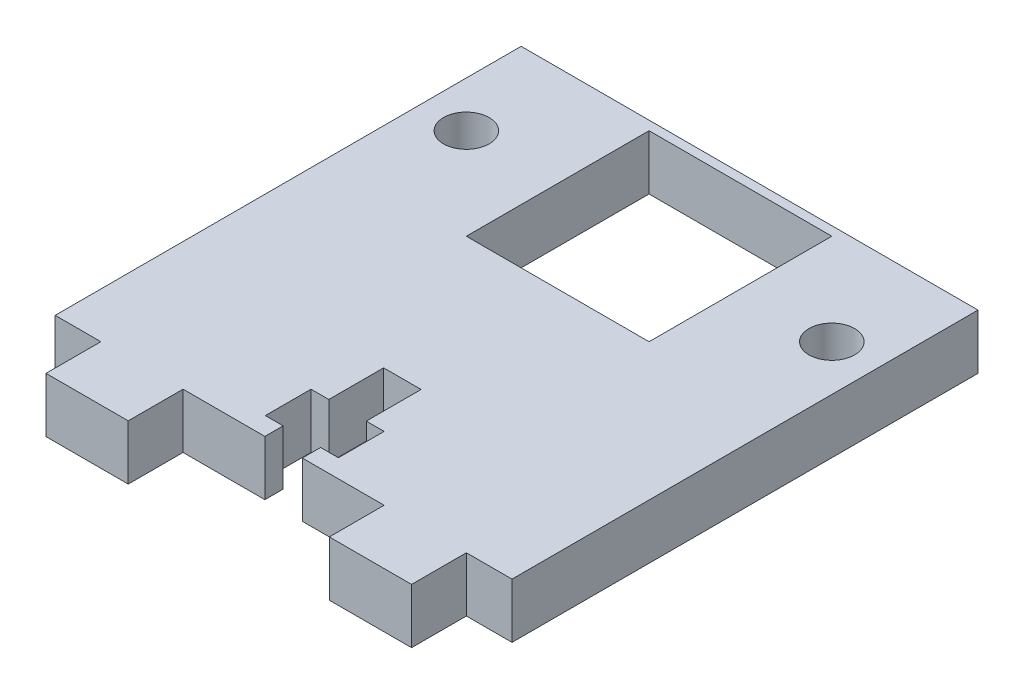
ISO-10303-21;
HEADER;
FILE_DESCRIPTION(('STEP AP214'),'2;1');
FILE_NAME('part.step','',(''),(''),'','','');
FILE_SCHEMA(('AUTOMOTIVE_DESIGN { 1 0 10303 214 1 1 1 1 }'));
ENDSEC;
DATA;
#1=APPLICATION_CONTEXT('core data for automotive mechanical design processes');
#2=APPLICATION_PROTOCOL_DEFINITION('international standard','automotive_design',2000,#1);
#3=PRODUCT_CONTEXT('',#1,'mechanical');
#4=PRODUCT('Part','Part','',(#3));
#5=PRODUCT_RELATED_PRODUCT_CATEGORY('part','',(#4));
#6=PRODUCT_DEFINITION_FORMATION('','',#4);
#7=PRODUCT_DEFINITION_CONTEXT('part definition',#1,'design');
#8=PRODUCT_DEFINITION('design','',#6,#7);
#9=PRODUCT_DEFINITION_SHAPE('','',#8);
#10=(LENGTH_UNIT() NAMED_UNIT(*) SI_UNIT(.MILLI.,.METRE.));
#11=(NAMED_UNIT(*) PLANE_ANGLE_UNIT() SI_UNIT($,.RADIAN.));
#12=(NAMED_UNIT(*) SI_UNIT($,.STERADIAN.) SOLID_ANGLE_UNIT());
#13=UNCERTAINTY_MEASURE_WITH_UNIT(LENGTH_MEASURE(1.E-05),#10,'distance_accuracy_value','');
#14=(GEOMETRIC_REPRESENTATION_CONTEXT(3) GLOBAL_UNCERTAINTY_ASSIGNED_CONTEXT((#13)) GLOBAL_UNIT_ASSIGNED_CONTEXT((#10,
#11,#12)) REPRESENTATION_CONTEXT('',''));
#15=CARTESIAN_POINT('',(0.,0.,0.));
#16=DIRECTION('',(0.,0.,1.));
#17=DIRECTION('',(1.,0.,0.));
#18=AXIS2_PLACEMENT_3D('',#15,#16,#17);
#19=CARTESIAN_POINT('',(0.,6.,0.));
#20=DIRECTION('',(0.,-1.,0.));
#21=DIRECTION('',(0.,0.,-1.));
#22=AXIS2_PLACEMENT_3D('',#19,#20,#21);
#23=PLANE('',#22);
#24=CARTESIAN_POINT('',(20.,6.,0.));
#25=DIRECTION('',(0.,1.,0.));
#26=DIRECTION('',(0.,0.,1.));
#27=AXIS2_PLACEMENT_3D('',#24,#25,#26);
#28=CIRCLE('',#27,2.5);
#29=CARTESIAN_POINT('',(20.,6.,2.5));
#30=VERTEX_POINT('',#29);
#31=EDGE_CURVE('E812',#30,#30,#28,.T.);
#32=ORIENTED_EDGE('',*,*,#31,.F.);
#33=EDGE_LOOP('',(#32));
#34=FACE_BOUND('',#33,.T.);
#35=CARTESIAN_POINT('',(-20.,6.,0.));
#36=DIRECTION('',(0.,1.,0.));
#37=DIRECTION('',(0.,0.,1.));
#38=AXIS2_PLACEMENT_3D('',#35,#36,#37);
#39=CIRCLE('',#38,2.5);
#40=CARTESIAN_POINT('',(-20.,6.,2.5));
#41=VERTEX_POINT('',#40);
#42=EDGE_CURVE('E244',#41,#41,#39,.T.);
#43=ORIENTED_EDGE('',*,*,#42,.F.);
#44=EDGE_LOOP('',(#43));
#45=FACE_BOUND('',#44,.T.);
#46=DIRECTION('',(0.,0.,1.));
#47=VECTOR('',#46,1.);
#48=CARTESIAN_POINT('',(-25.,6.,-11.));
#49=LINE('',#48,#47);
#50=CARTESIAN_POINT('',(-25.,6.,-11.));
#51=VERTEX_POINT('',#50);
#52=CARTESIAN_POINT('',(-25.,6.,40.));
#53=VERTEX_POINT('',#52);
#54=EDGE_CURVE('E254',#51,#53,#49,.T.);
#55=ORIENTED_EDGE('',*,*,#54,.T.);
#56=DIRECTION('',(-1.,0.,0.));
#57=VECTOR('',#56,1.);
#58=CARTESIAN_POINT('',(-20.0040908273477,6.,40.));
#59=LINE('',#58,#57);
#60=CARTESIAN_POINT('',(-20.0040908273477,6.,40.));
#61=VERTEX_POINT('',#60);
#62=EDGE_CURVE('E256',#61,#53,#59,.T.);
#63=ORIENTED_EDGE('',*,*,#62,.F.);
#64=DIRECTION('',(0.,0.,-1.));
#65=VECTOR('',#64,1.);
#66=CARTESIAN_POINT('',(-20.0040908273477,6.,46.));
#67=LINE('',#66,#65);
#68=CARTESIAN_POINT('',(-20.0040908273477,6.,46.));
#69=VERTEX_POINT('',#68);
#70=EDGE_CURVE('E260',#69,#61,#67,.T.);
#71=ORIENTED_EDGE('',*,*,#70,.F.);
#72=DIRECTION('',(-1.,0.,0.));
#73=VECTOR('',#72,1.);
#74=CARTESIAN_POINT('',(-11.0040908273477,6.,46.));
#75=LINE('',#74,#73);
#76=CARTESIAN_POINT('',(-11.0040908273477,6.,46.));
#77=VERTEX_POINT('',#76);
#78=EDGE_CURVE('E263',#77,#69,#75,.T.);
#79=ORIENTED_EDGE('',*,*,#78,.F.);
#80=DIRECTION('',(0.,0.,1.));
#81=VECTOR('',#80,1.);
#82=CARTESIAN_POINT('',(-11.0040908273477,6.,40.));
#83=LINE('',#82,#81);
#84=CARTESIAN_POINT('',(-11.0040908273477,6.,40.));
#85=VERTEX_POINT('',#84);
#86=EDGE_CURVE('E266',#85,#77,#83,.T.);
#87=ORIENTED_EDGE('',*,*,#86,.F.);
#88=DIRECTION('',(1.,0.,0.));
#89=VECTOR('',#88,1.);
#90=CARTESIAN_POINT('',(-11.0040908273477,6.,40.));
#91=LINE('',#90,#89);
#92=CARTESIAN_POINT('',(-2.05,6.,40.));
#93=VERTEX_POINT('',#92);
#94=EDGE_CURVE('E269',#85,#93,#91,.T.);
#95=ORIENTED_EDGE('',*,*,#94,.T.);
#96=DIRECTION('',(0.,0.,-1.));
#97=VECTOR('',#96,1.);
#98=CARTESIAN_POINT('',(-2.05,6.,40.));
#99=LINE('',#98,#97);
#100=CARTESIAN_POINT('',(-2.05,6.,38.));
#101=VERTEX_POINT('',#100);
#102=EDGE_CURVE('E271',#93,#101,#99,.T.);
#103=ORIENTED_EDGE('',*,*,#102,.T.);
#104=DIRECTION('',(-1.,0.,0.));
#105=VECTOR('',#104,1.);
#106=CARTESIAN_POINT('',(-2.05,6.,38.));
#107=LINE('',#106,#105);
#108=CARTESIAN_POINT('',(-4.,6.,38.));
#109=VERTEX_POINT('',#108);
#110=EDGE_CURVE('E273',#101,#109,#107,.T.);
#111=ORIENTED_EDGE('',*,*,#110,.T.);
#112=DIRECTION('',(0.,0.,-1.));
#113=VECTOR('',#112,1.);
#114=CARTESIAN_POINT('',(-4.,6.,38.));
#115=LINE('',#114,#113);
#116=CARTESIAN_POINT('',(-4.,6.,33.));
#117=VERTEX_POINT('',#116);
#118=EDGE_CURVE('E275',#109,#117,#115,.T.);
#119=ORIENTED_EDGE('',*,*,#118,.T.);
#120=DIRECTION('',(1.,0.,0.));
#121=VECTOR('',#120,1.);
#122=CARTESIAN_POINT('',(-4.,6.,33.));
#123=LINE('',#122,#121);
#124=CARTESIAN_POINT('',(-2.05,6.,33.));
#125=VERTEX_POINT('',#124);
#126=EDGE_CURVE('E277',#117,#125,#123,.T.);
#127=ORIENTED_EDGE('',*,*,#126,.T.);
#128=DIRECTION('',(0.,0.,-1.));
#129=VECTOR('',#128,1.);
#130=CARTESIAN_POINT('',(-2.05,6.,33.));
#131=LINE('',#130,#129);
#132=CARTESIAN_POINT('',(-2.05,6.,27.0000000000001));
#133=VERTEX_POINT('',#132);
#134=EDGE_CURVE('E279',#125,#133,#131,.T.);
#135=ORIENTED_EDGE('',*,*,#134,.T.);
#136=DIRECTION('',(1.,0.,0.));
#137=VECTOR('',#136,1.);
#138=CARTESIAN_POINT('',(-2.05,6.,27.0000000000001));
#139=LINE('',#138,#137);
#140=CARTESIAN_POINT('',(2.05,6.,27.0000000000001));
#141=VERTEX_POINT('',#140);
#142=EDGE_CURVE('E281',#133,#141,#139,.T.);
#143=ORIENTED_EDGE('',*,*,#142,.T.);
#144=DIRECTION('',(0.,0.,1.));
#145=VECTOR('',#144,1.);
#146=CARTESIAN_POINT('',(2.05,6.,27.0000000000001));
#147=LINE('',#146,#145);
#148=CARTESIAN_POINT('',(2.05,6.,33.));
#149=VERTEX_POINT('',#148);
#150=EDGE_CURVE('E283',#141,#149,#147,.T.);
#151=ORIENTED_EDGE('',*,*,#150,.T.);
#152=DIRECTION('',(1.,0.,0.));
#153=VECTOR('',#152,1.);
#154=CARTESIAN_POINT('',(2.05,6.,33.));
#155=LINE('',#154,#153);
#156=CARTESIAN_POINT('',(4.,6.,33.));
#157=VERTEX_POINT('',#156);
#158=EDGE_CURVE('E285',#149,#157,#155,.T.);
#159=ORIENTED_EDGE('',*,*,#158,.T.);
#160=DIRECTION('',(0.,0.,1.));
#161=VECTOR('',#160,1.);
#162=CARTESIAN_POINT('',(4.,6.,33.));
#163=LINE('',#162,#161);
#164=CARTESIAN_POINT('',(4.,6.,38.));
#165=VERTEX_POINT('',#164);
#166=EDGE_CURVE('E287',#157,#165,#163,.T.);
#167=ORIENTED_EDGE('',*,*,#166,.T.);
#168=DIRECTION('',(-1.,0.,0.));
#169=VECTOR('',#168,1.);
#170=CARTESIAN_POINT('',(4.,6.,38.));
#171=LINE('',#170,#169);
#172=CARTESIAN_POINT('',(2.05,6.,38.));
#173=VERTEX_POINT('',#172);
#174=EDGE_CURVE('E289',#165,#173,#171,.T.);
#175=ORIENTED_EDGE('',*,*,#174,.T.);
#176=DIRECTION('',(0.,0.,1.));
#177=VECTOR('',#176,1.);
#178=CARTESIAN_POINT('',(2.05,6.,38.));
#179=LINE('',#178,#177);
#180=CARTESIAN_POINT('',(2.05,6.,40.));
#181=VERTEX_POINT('',#180);
#182=EDGE_CURVE('E291',#173,#181,#179,.T.);
#183=ORIENTED_EDGE('',*,*,#182,.T.);
#184=DIRECTION('',(1.,0.,0.));
#185=VECTOR('',#184,1.);
#186=CARTESIAN_POINT('',(2.05,6.,40.));
#187=LINE('',#186,#185);
#188=CARTESIAN_POINT('',(11.0040908273477,6.,40.));
#189=VERTEX_POINT('',#188);
#190=EDGE_CURVE('E293',#181,#189,#187,.T.);
#191=ORIENTED_EDGE('',*,*,#190,.T.);
#192=DIRECTION('',(0.,0.,-1.));
#193=VECTOR('',#192,1.);
#194=CARTESIAN_POINT('',(11.0040908273477,6.,46.));
#195=LINE('',#194,#193);
#196=CARTESIAN_POINT('',(11.0040908273477,6.,46.));
#197=VERTEX_POINT('',#196);
#198=EDGE_CURVE('E295',#197,#189,#195,.T.);
#199=ORIENTED_EDGE('',*,*,#198,.F.);
#200=DIRECTION('',(-1.,0.,0.));
#201=VECTOR('',#200,1.);
#202=CARTESIAN_POINT('',(20.0040908273477,6.,46.));
#203=LINE('',#202,#201);
#204=CARTESIAN_POINT('',(20.0040908273477,6.,46.));
#205=VERTEX_POINT('',#204);
#206=EDGE_CURVE('E298',#205,#197,#203,.T.);
#207=ORIENTED_EDGE('',*,*,#206,.F.);
#208=DIRECTION('',(0.,0.,1.));
#209=VECTOR('',#208,1.);
#210=CARTESIAN_POINT('',(20.0040908273477,6.,40.));
#211=LINE('',#210,#209);
#212=CARTESIAN_POINT('',(20.0040908273477,6.,40.));
#213=VERTEX_POINT('',#212);
#214=EDGE_CURVE('E301',#213,#205,#211,.T.);
#215=ORIENTED_EDGE('',*,*,#214,.F.);
#216=DIRECTION('',(-1.,0.,0.));
#217=VECTOR('',#216,1.);
#218=CARTESIAN_POINT('',(25.,6.,40.));
#219=LINE('',#218,#217);
#220=CARTESIAN_POINT('',(25.,6.,40.));
#221=VERTEX_POINT('',#220);
#222=EDGE_CURVE('E304',#221,#213,#219,.T.);
#223=ORIENTED_EDGE('',*,*,#222,.F.);
#224=DIRECTION('',(0.,0.,-1.));
#225=VECTOR('',#224,1.);
#226=CARTESIAN_POINT('',(25.,6.,40.));
#227=LINE('',#226,#225);
#228=CARTESIAN_POINT('',(25.,6.,-11.));
#229=VERTEX_POINT('',#228);
#230=EDGE_CURVE('E307',#221,#229,#227,.T.);
#231=ORIENTED_EDGE('',*,*,#230,.T.);
#232=DIRECTION('',(1.,0.,0.));
#233=VECTOR('',#232,1.);
#234=CARTESIAN_POINT('',(-25.,6.,-11.));
#235=LINE('',#234,#233);
#236=EDGE_CURVE('E309',#51,#229,#235,.T.);
#237=ORIENTED_EDGE('',*,*,#236,.F.);
#238=EDGE_LOOP('',(#55,#63,#71,#79,#87,#95,#103,#111,#119,#127,#135,#143,#151,#159,#167,#175,
#183,#191,#199,#207,#215,#223,#231,#237));
#239=FACE_BOUND('',#238,.T.);
#240=DIRECTION('',(0.,0.,-1.));
#241=VECTOR('',#240,1.);
#242=CARTESIAN_POINT('',(10.,6.,10.));
#243=LINE('',#242,#241);
#244=CARTESIAN_POINT('',(10.,6.,10.));
#245=VERTEX_POINT('',#244);
#246=CARTESIAN_POINT('',(10.,6.,-9.99999999999999));
#247=VERTEX_POINT('',#246);
#248=EDGE_CURVE('E216',#245,#247,#243,.T.);
#249=ORIENTED_EDGE('',*,*,#248,.F.);
#250=DIRECTION('',(1.,0.,0.));
#251=VECTOR('',#250,1.);
#252=CARTESIAN_POINT('',(-10.,6.,10.));
#253=LINE('',#252,#251);
#254=CARTESIAN_POINT('',(-10.,6.,10.));
#255=VERTEX_POINT('',#254);
#256=EDGE_CURVE('E238',#255,#245,#253,.T.);
#257=ORIENTED_EDGE('',*,*,#256,.F.);
#258=DIRECTION('',(0.,0.,1.));
#259=VECTOR('',#258,1.);
#260=CARTESIAN_POINT('',(-10.,6.,10.));
#261=LINE('',#260,#259);
#262=CARTESIAN_POINT('',(-10.,6.,-9.99999999999999));
#263=VERTEX_POINT('',#262);
#264=EDGE_CURVE('E236',#263,#255,#261,.T.);
#265=ORIENTED_EDGE('',*,*,#264,.F.);
#266=DIRECTION('',(-1.,0.,0.));
#267=VECTOR('',#266,1.);
#268=CARTESIAN_POINT('',(-10.,6.,-9.99999999999999));
#269=LINE('',#268,#267);
#270=EDGE_CURVE('E224',#247,#263,#269,.T.);
#271=ORIENTED_EDGE('',*,*,#270,.F.);
#272=EDGE_LOOP('',(#249,#257,#265,#271));
#273=FACE_BOUND('',#272,.T.);
#274=ADVANCED_FACE('F32',(#34,#45,#239,#273),#23,.F.);
#275=CARTESIAN_POINT('',(0.,0.,0.));
#276=DIRECTION('',(0.,-1.,0.));
#277=DIRECTION('',(0.,0.,-1.));
#278=AXIS2_PLACEMENT_3D('',#275,#276,#277);
#279=PLANE('',#278);
#280=CARTESIAN_POINT('',(20.,0.,0.));
#281=DIRECTION('',(0.,1.,0.));
#282=DIRECTION('',(0.,0.,1.));
#283=AXIS2_PLACEMENT_3D('',#280,#281,#282);
#284=CIRCLE('',#283,2.5);
#285=CARTESIAN_POINT('',(20.,0.,2.5));
#286=VERTEX_POINT('',#285);
#287=EDGE_CURVE('E815',#286,#286,#284,.T.);
#288=ORIENTED_EDGE('',*,*,#287,.T.);
#289=EDGE_LOOP('',(#288));
#290=FACE_BOUND('',#289,.T.);
#291=CARTESIAN_POINT('',(-20.,0.,0.));
#292=DIRECTION('',(0.,1.,0.));
#293=DIRECTION('',(0.,0.,1.));
#294=AXIS2_PLACEMENT_3D('',#291,#292,#293);
#295=CIRCLE('',#294,2.5);
#296=CARTESIAN_POINT('',(-20.,0.,2.5));
#297=VERTEX_POINT('',#296);
#298=EDGE_CURVE('E817',#297,#297,#295,.T.);
#299=ORIENTED_EDGE('',*,*,#298,.T.);
#300=EDGE_LOOP('',(#299));
#301=FACE_BOUND('',#300,.T.);
#302=DIRECTION('',(0.,0.,1.));
#303=VECTOR('',#302,1.);
#304=CARTESIAN_POINT('',(-25.,0.,11.));
#305=LINE('',#304,#303);
#306=CARTESIAN_POINT('',(-25.,0.,-11.));
#307=VERTEX_POINT('',#306);
#308=CARTESIAN_POINT('',(-25.,0.,40.));
#309=VERTEX_POINT('',#308);
#310=EDGE_CURVE('E232',#307,#309,#305,.T.);
#311=ORIENTED_EDGE('',*,*,#310,.F.);
#312=DIRECTION('',(1.,0.,0.));
#313=VECTOR('',#312,1.);
#314=CARTESIAN_POINT('',(-25.,0.,-11.));
#315=LINE('',#314,#313);
#316=CARTESIAN_POINT('',(25.,0.,-11.));
#317=VERTEX_POINT('',#316);
#318=EDGE_CURVE('E257',#307,#317,#315,.T.);
#319=ORIENTED_EDGE('',*,*,#318,.T.);
#320=DIRECTION('',(0.,0.,1.));
#321=VECTOR('',#320,1.);
#322=CARTESIAN_POINT('',(25.,0.,-11.));
#323=LINE('',#322,#321);
#324=CARTESIAN_POINT('',(25.,0.,40.));
#325=VERTEX_POINT('',#324);
#326=EDGE_CURVE('E366',#317,#325,#323,.T.);
#327=ORIENTED_EDGE('',*,*,#326,.T.);
#328=DIRECTION('',(-1.,0.,0.));
#329=VECTOR('',#328,1.);
#330=CARTESIAN_POINT('',(25.,0.,40.));
#331=LINE('',#330,#329);
#332=CARTESIAN_POINT('',(20.0040908273477,0.,40.));
#333=VERTEX_POINT('',#332);
#334=EDGE_CURVE('E363',#325,#333,#331,.T.);
#335=ORIENTED_EDGE('',*,*,#334,.T.);
#336=DIRECTION('',(0.,0.,1.));
#337=VECTOR('',#336,1.);
#338=CARTESIAN_POINT('',(20.0040908273477,0.,40.));
#339=LINE('',#338,#337);
#340=CARTESIAN_POINT('',(20.0040908273477,0.,46.));
#341=VERTEX_POINT('',#340);
#342=EDGE_CURVE('E360',#333,#341,#339,.T.);
#343=ORIENTED_EDGE('',*,*,#342,.T.);
#344=DIRECTION('',(-1.,0.,0.));
#345=VECTOR('',#344,1.);
#346=CARTESIAN_POINT('',(20.0040908273477,0.,46.));
#347=LINE('',#346,#345);
#348=CARTESIAN_POINT('',(11.0040908273477,0.,46.));
#349=VERTEX_POINT('',#348);
#350=EDGE_CURVE('E357',#341,#349,#347,.T.);
#351=ORIENTED_EDGE('',*,*,#350,.T.);
#352=DIRECTION('',(0.,0.,-1.));
#353=VECTOR('',#352,1.);
#354=CARTESIAN_POINT('',(11.0040908273477,0.,46.));
#355=LINE('',#354,#353);
#356=CARTESIAN_POINT('',(11.0040908273477,0.,40.));
#357=VERTEX_POINT('',#356);
#358=EDGE_CURVE('E354',#349,#357,#355,.T.);
#359=ORIENTED_EDGE('',*,*,#358,.T.);
#360=DIRECTION('',(1.,0.,0.));
#361=VECTOR('',#360,1.);
#362=CARTESIAN_POINT('',(2.05,0.,40.));
#363=LINE('',#362,#361);
#364=CARTESIAN_POINT('',(2.05,0.,40.));
#365=VERTEX_POINT('',#364);
#366=EDGE_CURVE('E351',#365,#357,#363,.T.);
#367=ORIENTED_EDGE('',*,*,#366,.F.);
#368=DIRECTION('',(0.,0.,1.));
#369=VECTOR('',#368,1.);
#370=CARTESIAN_POINT('',(2.05,0.,38.));
#371=LINE('',#370,#369);
#372=CARTESIAN_POINT('',(2.05,0.,38.));
#373=VERTEX_POINT('',#372);
#374=EDGE_CURVE('E349',#373,#365,#371,.T.);
#375=ORIENTED_EDGE('',*,*,#374,.F.);
#376=DIRECTION('',(-1.,0.,0.));
#377=VECTOR('',#376,1.);
#378=CARTESIAN_POINT('',(4.,0.,38.));
#379=LINE('',#378,#377);
#380=CARTESIAN_POINT('',(4.,0.,38.));
#381=VERTEX_POINT('',#380);
#382=EDGE_CURVE('E347',#381,#373,#379,.T.);
#383=ORIENTED_EDGE('',*,*,#382,.F.);
#384=DIRECTION('',(0.,0.,1.));
#385=VECTOR('',#384,1.);
#386=CARTESIAN_POINT('',(4.,0.,33.));
#387=LINE('',#386,#385);
#388=CARTESIAN_POINT('',(4.,0.,33.));
#389=VERTEX_POINT('',#388);
#390=EDGE_CURVE('E345',#389,#381,#387,.T.);
#391=ORIENTED_EDGE('',*,*,#390,.F.);
#392=DIRECTION('',(1.,0.,0.));
#393=VECTOR('',#392,1.);
#394=CARTESIAN_POINT('',(2.05,0.,33.));
#395=LINE('',#394,#393);
#396=CARTESIAN_POINT('',(2.05,0.,33.));
#397=VERTEX_POINT('',#396);
#398=EDGE_CURVE('E343',#397,#389,#395,.T.);
#399=ORIENTED_EDGE('',*,*,#398,.F.);
#400=DIRECTION('',(0.,0.,1.));
#401=VECTOR('',#400,1.);
#402=CARTESIAN_POINT('',(2.05,0.,27.0000000000001));
#403=LINE('',#402,#401);
#404=CARTESIAN_POINT('',(2.05,0.,27.0000000000001));
#405=VERTEX_POINT('',#404);
#406=EDGE_CURVE('E341',#405,#397,#403,.T.);
#407=ORIENTED_EDGE('',*,*,#406,.F.);
#408=DIRECTION('',(1.,0.,0.));
#409=VECTOR('',#408,1.);
#410=CARTESIAN_POINT('',(-2.05,0.,27.0000000000001));
#411=LINE('',#410,#409);
#412=CARTESIAN_POINT('',(-2.05,0.,27.0000000000001));
#413=VERTEX_POINT('',#412);
#414=EDGE_CURVE('E339',#413,#405,#411,.T.);
#415=ORIENTED_EDGE('',*,*,#414,.F.);
#416=DIRECTION('',(0.,0.,-1.));
#417=VECTOR('',#416,1.);
#418=CARTESIAN_POINT('',(-2.05,0.,33.));
#419=LINE('',#418,#417);
#420=CARTESIAN_POINT('',(-2.05,0.,33.));
#421=VERTEX_POINT('',#420);
#422=EDGE_CURVE('E337',#421,#413,#419,.T.);
#423=ORIENTED_EDGE('',*,*,#422,.F.);
#424=DIRECTION('',(1.,0.,0.));
#425=VECTOR('',#424,1.);
#426=CARTESIAN_POINT('',(-4.,0.,33.));
#427=LINE('',#426,#425);
#428=CARTESIAN_POINT('',(-4.,0.,33.));
#429=VERTEX_POINT('',#428);
#430=EDGE_CURVE('E335',#429,#421,#427,.T.);
#431=ORIENTED_EDGE('',*,*,#430,.F.);
#432=DIRECTION('',(0.,0.,-1.));
#433=VECTOR('',#432,1.);
#434=CARTESIAN_POINT('',(-4.,0.,38.));
#435=LINE('',#434,#433);
#436=CARTESIAN_POINT('',(-4.,0.,38.));
#437=VERTEX_POINT('',#436);
#438=EDGE_CURVE('E333',#437,#429,#435,.T.);
#439=ORIENTED_EDGE('',*,*,#438,.F.);
#440=DIRECTION('',(-1.,0.,0.));
#441=VECTOR('',#440,1.);
#442=CARTESIAN_POINT('',(-2.05,0.,38.));
#443=LINE('',#442,#441);
#444=CARTESIAN_POINT('',(-2.05,0.,38.));
#445=VERTEX_POINT('',#444);
#446=EDGE_CURVE('E331',#445,#437,#443,.T.);
#447=ORIENTED_EDGE('',*,*,#446,.F.);
#448=DIRECTION('',(0.,0.,-1.));
#449=VECTOR('',#448,1.);
#450=CARTESIAN_POINT('',(-2.05,0.,40.));
#451=LINE('',#450,#449);
#452=CARTESIAN_POINT('',(-2.05,0.,40.));
#453=VERTEX_POINT('',#452);
#454=EDGE_CURVE('E329',#453,#445,#451,.T.);
#455=ORIENTED_EDGE('',*,*,#454,.F.);
#456=DIRECTION('',(1.,0.,0.));
#457=VECTOR('',#456,1.);
#458=CARTESIAN_POINT('',(-11.0040908273477,0.,40.));
#459=LINE('',#458,#457);
#460=CARTESIAN_POINT('',(-11.0040908273477,0.,40.));
#461=VERTEX_POINT('',#460);
#462=EDGE_CURVE('E327',#461,#453,#459,.T.);
#463=ORIENTED_EDGE('',*,*,#462,.F.);
#464=DIRECTION('',(0.,0.,1.));
#465=VECTOR('',#464,1.);
#466=CARTESIAN_POINT('',(-11.0040908273477,0.,40.));
#467=LINE('',#466,#465);
#468=CARTESIAN_POINT('',(-11.0040908273477,0.,46.));
#469=VERTEX_POINT('',#468);
#470=EDGE_CURVE('E324',#461,#469,#467,.T.);
#471=ORIENTED_EDGE('',*,*,#470,.T.);
#472=DIRECTION('',(-1.,0.,0.));
#473=VECTOR('',#472,1.);
#474=CARTESIAN_POINT('',(-11.0040908273477,0.,46.));
#475=LINE('',#474,#473);
#476=CARTESIAN_POINT('',(-20.0040908273477,0.,46.));
#477=VERTEX_POINT('',#476);
#478=EDGE_CURVE('E321',#469,#477,#475,.T.);
#479=ORIENTED_EDGE('',*,*,#478,.T.);
#480=DIRECTION('',(0.,0.,-1.));
#481=VECTOR('',#480,1.);
#482=CARTESIAN_POINT('',(-20.0040908273477,0.,46.));
#483=LINE('',#482,#481);
#484=CARTESIAN_POINT('',(-20.0040908273477,0.,40.));
#485=VERTEX_POINT('',#484);
#486=EDGE_CURVE('E318',#477,#485,#483,.T.);
#487=ORIENTED_EDGE('',*,*,#486,.T.);
#488=DIRECTION('',(-1.,0.,0.));
#489=VECTOR('',#488,1.);
#490=CARTESIAN_POINT('',(-20.0040908273477,0.,40.));
#491=LINE('',#490,#489);
#492=EDGE_CURVE('E315',#485,#309,#491,.T.);
#493=ORIENTED_EDGE('',*,*,#492,.T.);
#494=EDGE_LOOP('',(#311,#319,#327,#335,#343,#351,#359,#367,#375,#383,#391,#399,#407,#415,#423,
#431,#439,#447,#455,#463,#471,#479,#487,#493));
#495=FACE_BOUND('',#494,.T.);
#496=DIRECTION('',(1.,0.,0.));
#497=VECTOR('',#496,1.);
#498=CARTESIAN_POINT('',(-10.,0.,10.));
#499=LINE('',#498,#497);
#500=CARTESIAN_POINT('',(-10.,0.,10.));
#501=VERTEX_POINT('',#500);
#502=CARTESIAN_POINT('',(10.,0.,10.));
#503=VERTEX_POINT('',#502);
#504=EDGE_CURVE('E225',#501,#503,#499,.T.);
#505=ORIENTED_EDGE('',*,*,#504,.T.);
#506=DIRECTION('',(0.,0.,-1.));
#507=VECTOR('',#506,1.);
#508=CARTESIAN_POINT('',(10.,0.,10.));
#509=LINE('',#508,#507);
#510=CARTESIAN_POINT('',(10.,0.,-9.99999999999999));
#511=VERTEX_POINT('',#510);
#512=EDGE_CURVE('E55',#503,#511,#509,.T.);
#513=ORIENTED_EDGE('',*,*,#512,.T.);
#514=DIRECTION('',(-1.,0.,0.));
#515=VECTOR('',#514,1.);
#516=CARTESIAN_POINT('',(-10.,0.,-9.99999999999999));
#517=LINE('',#516,#515);
#518=CARTESIAN_POINT('',(-10.,0.,-9.99999999999999));
#519=VERTEX_POINT('',#518);
#520=EDGE_CURVE('E231',#511,#519,#517,.T.);
#521=ORIENTED_EDGE('',*,*,#520,.T.);
#522=DIRECTION('',(0.,0.,1.));
#523=VECTOR('',#522,1.);
#524=CARTESIAN_POINT('',(-10.,0.,10.));
#525=LINE('',#524,#523);
#526=EDGE_CURVE('E246',#519,#501,#525,.T.);
#527=ORIENTED_EDGE('',*,*,#526,.T.);
#528=EDGE_LOOP('',(#505,#513,#521,#527));
#529=FACE_BOUND('',#528,.T.);
#530=ADVANCED_FACE('F436',(#290,#301,#495,#529),#279,.T.);
#531=CARTESIAN_POINT('',(-25.,6.,11.));
#532=DIRECTION('',(1.,0.,0.));
#533=DIRECTION('',(0.,0.,-1.));
#534=AXIS2_PLACEMENT_3D('',#531,#532,#533);
#535=PLANE('',#534);
#536=ORIENTED_EDGE('',*,*,#310,.T.);
#537=DIRECTION('',(0.,-1.,0.));
#538=VECTOR('',#537,1.);
#539=CARTESIAN_POINT('',(-25.,6.,40.));
#540=LINE('',#539,#538);
#541=EDGE_CURVE('E11',#53,#309,#540,.T.);
#542=ORIENTED_EDGE('',*,*,#541,.F.);
#543=ORIENTED_EDGE('',*,*,#54,.F.);
#544=DIRECTION('',(0.,-1.,0.));
#545=VECTOR('',#544,1.);
#546=CARTESIAN_POINT('',(-25.,6.,-11.));
#547=LINE('',#546,#545);
#548=EDGE_CURVE('E312',#51,#307,#547,.T.);
#549=ORIENTED_EDGE('',*,*,#548,.T.);
#550=EDGE_LOOP('',(#536,#542,#543,#549));
#551=FACE_BOUND('',#550,.T.);
#552=ADVANCED_FACE('F34',(#551),#535,.F.);
#553=CARTESIAN_POINT('',(-20.0040908273477,6.,40.));
#554=DIRECTION('',(0.,0.,1.));
#555=DIRECTION('',(1.,0.,0.));
#556=AXIS2_PLACEMENT_3D('',#553,#554,#555);
#557=PLANE('',#556);
#558=ORIENTED_EDGE('',*,*,#492,.F.);
#559=DIRECTION('',(0.,-1.,0.));
#560=VECTOR('',#559,1.);
#561=CARTESIAN_POINT('',(-20.0040908273477,6.,40.));
#562=LINE('',#561,#560);
#563=EDGE_CURVE('E40',#61,#485,#562,.T.);
#564=ORIENTED_EDGE('',*,*,#563,.F.);
#565=ORIENTED_EDGE('',*,*,#62,.T.);
#566=ORIENTED_EDGE('',*,*,#541,.T.);
#567=EDGE_LOOP('',(#558,#564,#565,#566));
#568=FACE_BOUND('',#567,.T.);
#569=ADVANCED_FACE('F433',(#568),#557,.T.);
#570=CARTESIAN_POINT('',(-20.0040908273477,6.,46.));
#571=DIRECTION('',(-1.,0.,0.));
#572=DIRECTION('',(0.,0.,1.));
#573=AXIS2_PLACEMENT_3D('',#570,#571,#572);
#574=PLANE('',#573);
#575=ORIENTED_EDGE('',*,*,#486,.F.);
#576=DIRECTION('',(0.,-1.,0.));
#577=VECTOR('',#576,1.);
#578=CARTESIAN_POINT('',(-20.0040908273477,6.,46.));
#579=LINE('',#578,#577);
#580=EDGE_CURVE('E425',#69,#477,#579,.T.);
#581=ORIENTED_EDGE('',*,*,#580,.F.);
#582=ORIENTED_EDGE('',*,*,#70,.T.);
#583=ORIENTED_EDGE('',*,*,#563,.T.);
#584=EDGE_LOOP('',(#575,#581,#582,#583));
#585=FACE_BOUND('',#584,.T.);
#586=ADVANCED_FACE('F429',(#585),#574,.T.);
#587=CARTESIAN_POINT('',(-11.0040908273477,6.,46.));
#588=DIRECTION('',(0.,0.,1.));
#589=DIRECTION('',(1.,0.,0.));
#590=AXIS2_PLACEMENT_3D('',#587,#588,#589);
#591=PLANE('',#590);
#592=ORIENTED_EDGE('',*,*,#478,.F.);
#593=DIRECTION('',(0.,-1.,0.));
#594=VECTOR('',#593,1.);
#595=CARTESIAN_POINT('',(-11.0040908273477,6.,46.));
#596=LINE('',#595,#594);
#597=EDGE_CURVE('E423',#77,#469,#596,.T.);
#598=ORIENTED_EDGE('',*,*,#597,.F.);
#599=ORIENTED_EDGE('',*,*,#78,.T.);
#600=ORIENTED_EDGE('',*,*,#580,.T.);
#601=EDGE_LOOP('',(#592,#598,#599,#600));
#602=FACE_BOUND('',#601,.T.);
#603=ADVANCED_FACE('F442',(#602),#591,.T.);
#604=CARTESIAN_POINT('',(-11.0040908273477,6.,40.));
#605=DIRECTION('',(1.,0.,0.));
#606=DIRECTION('',(0.,0.,-1.));
#607=AXIS2_PLACEMENT_3D('',#604,#605,#606);
#608=PLANE('',#607);
#609=ORIENTED_EDGE('',*,*,#470,.F.);
#610=DIRECTION('',(0.,-1.,0.));
#611=VECTOR('',#610,1.);
#612=CARTESIAN_POINT('',(-11.0040908273477,6.,40.));
#613=LINE('',#612,#611);
#614=EDGE_CURVE('E421',#85,#461,#613,.T.);
#615=ORIENTED_EDGE('',*,*,#614,.F.);
#616=ORIENTED_EDGE('',*,*,#86,.T.);
#617=ORIENTED_EDGE('',*,*,#597,.T.);
#618=EDGE_LOOP('',(#609,#615,#616,#617));
#619=FACE_BOUND('',#618,.T.);
#620=ADVANCED_FACE('F536',(#619),#608,.T.);
#621=CARTESIAN_POINT('',(-11.0040908273477,6.,40.));
#622=DIRECTION('',(0.,0.,-1.));
#623=DIRECTION('',(-1.,0.,0.));
#624=AXIS2_PLACEMENT_3D('',#621,#622,#623);
#625=PLANE('',#624);
#626=ORIENTED_EDGE('',*,*,#462,.T.);
#627=DIRECTION('',(0.,-1.,0.));
#628=VECTOR('',#627,1.);
#629=CARTESIAN_POINT('',(-2.05,6.,40.));
#630=LINE('',#629,#628);
#631=EDGE_CURVE('E418',#93,#453,#630,.T.);
#632=ORIENTED_EDGE('',*,*,#631,.F.);
#633=ORIENTED_EDGE('',*,*,#94,.F.);
#634=ORIENTED_EDGE('',*,*,#614,.T.);
#635=EDGE_LOOP('',(#626,#632,#633,#634));
#636=FACE_BOUND('',#635,.T.);
#637=ADVANCED_FACE('F538',(#636),#625,.F.);
#638=CARTESIAN_POINT('',(-2.05,6.,40.));
#639=DIRECTION('',(-1.,0.,0.));
#640=DIRECTION('',(0.,0.,1.));
#641=AXIS2_PLACEMENT_3D('',#638,#639,#640);
#642=PLANE('',#641);
#643=ORIENTED_EDGE('',*,*,#454,.T.);
#644=DIRECTION('',(0.,-1.,0.));
#645=VECTOR('',#644,1.);
#646=CARTESIAN_POINT('',(-2.05,6.,38.));
#647=LINE('',#646,#645);
#648=EDGE_CURVE('E415',#101,#445,#647,.T.);
#649=ORIENTED_EDGE('',*,*,#648,.F.);
#650=ORIENTED_EDGE('',*,*,#102,.F.);
#651=ORIENTED_EDGE('',*,*,#631,.T.);
#652=EDGE_LOOP('',(#643,#649,#650,#651));
#653=FACE_BOUND('',#652,.T.);
#654=ADVANCED_FACE('F532',(#653),#642,.F.);
#655=CARTESIAN_POINT('',(-2.05,6.,38.));
#656=DIRECTION('',(0.,0.,1.));
#657=DIRECTION('',(1.,0.,0.));
#658=AXIS2_PLACEMENT_3D('',#655,#656,#657);
#659=PLANE('',#658);
#660=ORIENTED_EDGE('',*,*,#446,.T.);
#661=DIRECTION('',(0.,-1.,0.));
#662=VECTOR('',#661,1.);
#663=CARTESIAN_POINT('',(-4.,6.,38.));
#664=LINE('',#663,#662);
#665=EDGE_CURVE('E412',#109,#437,#664,.T.);
#666=ORIENTED_EDGE('',*,*,#665,.F.);
#667=ORIENTED_EDGE('',*,*,#110,.F.);
#668=ORIENTED_EDGE('',*,*,#648,.T.);
#669=EDGE_LOOP('',(#660,#666,#667,#668));
#670=FACE_BOUND('',#669,.T.);
#671=ADVANCED_FACE('F528',(#670),#659,.F.);
#672=CARTESIAN_POINT('',(-4.,6.,38.));
#673=DIRECTION('',(-1.,0.,0.));
#674=DIRECTION('',(0.,0.,1.));
#675=AXIS2_PLACEMENT_3D('',#672,#673,#674);
#676=PLANE('',#675);
#677=ORIENTED_EDGE('',*,*,#438,.T.);
#678=DIRECTION('',(0.,-1.,0.));
#679=VECTOR('',#678,1.);
#680=CARTESIAN_POINT('',(-4.,6.,33.));
#681=LINE('',#680,#679);
#682=EDGE_CURVE('E409',#117,#429,#681,.T.);
#683=ORIENTED_EDGE('',*,*,#682,.F.);
#684=ORIENTED_EDGE('',*,*,#118,.F.);
#685=ORIENTED_EDGE('',*,*,#665,.T.);
#686=EDGE_LOOP('',(#677,#683,#684,#685));
#687=FACE_BOUND('',#686,.T.);
#688=ADVANCED_FACE('F523',(#687),#676,.F.);
#689=CARTESIAN_POINT('',(-4.,6.,33.));
#690=DIRECTION('',(0.,0.,-1.));
#691=DIRECTION('',(-1.,0.,0.));
#692=AXIS2_PLACEMENT_3D('',#689,#690,#691);
#693=PLANE('',#692);
#694=ORIENTED_EDGE('',*,*,#430,.T.);
#695=DIRECTION('',(0.,-1.,0.));
#696=VECTOR('',#695,1.);
#697=CARTESIAN_POINT('',(-2.05,6.,33.));
#698=LINE('',#697,#696);
#699=EDGE_CURVE('E406',#125,#421,#698,.T.);
#700=ORIENTED_EDGE('',*,*,#699,.F.);
#701=ORIENTED_EDGE('',*,*,#126,.F.);
#702=ORIENTED_EDGE('',*,*,#682,.T.);
#703=EDGE_LOOP('',(#694,#700,#701,#702));
#704=FACE_BOUND('',#703,.T.);
#705=ADVANCED_FACE('F517',(#704),#693,.F.);
#706=CARTESIAN_POINT('',(-2.05,6.,33.));
#707=DIRECTION('',(-1.,0.,0.));
#708=DIRECTION('',(0.,0.,1.));
#709=AXIS2_PLACEMENT_3D('',#706,#707,#708);
#710=PLANE('',#709);
#711=ORIENTED_EDGE('',*,*,#422,.T.);
#712=DIRECTION('',(0.,-1.,0.));
#713=VECTOR('',#712,1.);
#714=CARTESIAN_POINT('',(-2.05,6.,27.0000000000001));
#715=LINE('',#714,#713);
#716=EDGE_CURVE('E403',#133,#413,#715,.T.);
#717=ORIENTED_EDGE('',*,*,#716,.F.);
#718=ORIENTED_EDGE('',*,*,#134,.F.);
#719=ORIENTED_EDGE('',*,*,#699,.T.);
#720=EDGE_LOOP('',(#711,#717,#718,#719));
#721=FACE_BOUND('',#720,.T.);
#722=ADVANCED_FACE('F513',(#721),#710,.F.);
#723=CARTESIAN_POINT('',(-2.05,6.,27.0000000000001));
#724=DIRECTION('',(0.,0.,-1.));
#725=DIRECTION('',(-1.,0.,0.));
#726=AXIS2_PLACEMENT_3D('',#723,#724,#725);
#727=PLANE('',#726);
#728=ORIENTED_EDGE('',*,*,#414,.T.);
#729=DIRECTION('',(0.,-1.,0.));
#730=VECTOR('',#729,1.);
#731=CARTESIAN_POINT('',(2.05,6.,27.0000000000001));
#732=LINE('',#731,#730);
#733=EDGE_CURVE('E400',#141,#405,#732,.T.);
#734=ORIENTED_EDGE('',*,*,#733,.F.);
#735=ORIENTED_EDGE('',*,*,#142,.F.);
#736=ORIENTED_EDGE('',*,*,#716,.T.);
#737=EDGE_LOOP('',(#728,#734,#735,#736));
#738=FACE_BOUND('',#737,.T.);
#739=ADVANCED_FACE('F508',(#738),#727,.F.);
#740=CARTESIAN_POINT('',(2.05,6.,27.0000000000001));
#741=DIRECTION('',(1.,0.,0.));
#742=DIRECTION('',(0.,0.,-1.));
#743=AXIS2_PLACEMENT_3D('',#740,#741,#742);
#744=PLANE('',#743);
#745=ORIENTED_EDGE('',*,*,#406,.T.);
#746=DIRECTION('',(0.,-1.,0.));
#747=VECTOR('',#746,1.);
#748=CARTESIAN_POINT('',(2.05,6.,33.));
#749=LINE('',#748,#747);
#750=EDGE_CURVE('E397',#149,#397,#749,.T.);
#751=ORIENTED_EDGE('',*,*,#750,.F.);
#752=ORIENTED_EDGE('',*,*,#150,.F.);
#753=ORIENTED_EDGE('',*,*,#733,.T.);
#754=EDGE_LOOP('',(#745,#751,#752,#753));
#755=FACE_BOUND('',#754,.T.);
#756=ADVANCED_FACE('F502',(#755),#744,.F.);
#757=CARTESIAN_POINT('',(2.05,6.,33.));
#758=DIRECTION('',(0.,0.,-1.));
#759=DIRECTION('',(-1.,0.,0.));
#760=AXIS2_PLACEMENT_3D('',#757,#758,#759);
#761=PLANE('',#760);
#762=ORIENTED_EDGE('',*,*,#398,.T.);
#763=DIRECTION('',(0.,-1.,0.));
#764=VECTOR('',#763,1.);
#765=CARTESIAN_POINT('',(4.,6.,33.));
#766=LINE('',#765,#764);
#767=EDGE_CURVE('E394',#157,#389,#766,.T.);
#768=ORIENTED_EDGE('',*,*,#767,.F.);
#769=ORIENTED_EDGE('',*,*,#158,.F.);
#770=ORIENTED_EDGE('',*,*,#750,.T.);
#771=EDGE_LOOP('',(#762,#768,#769,#770));
#772=FACE_BOUND('',#771,.T.);
#773=ADVANCED_FACE('F498',(#772),#761,.F.);
#774=CARTESIAN_POINT('',(4.,6.,33.));
#775=DIRECTION('',(1.,0.,0.));
#776=DIRECTION('',(0.,0.,-1.));
#777=AXIS2_PLACEMENT_3D('',#774,#775,#776);
#778=PLANE('',#777);
#779=ORIENTED_EDGE('',*,*,#390,.T.);
#780=DIRECTION('',(0.,-1.,0.));
#781=VECTOR('',#780,1.);
#782=CARTESIAN_POINT('',(4.,6.,38.));
#783=LINE('',#782,#781);
#784=EDGE_CURVE('E391',#165,#381,#783,.T.);
#785=ORIENTED_EDGE('',*,*,#784,.F.);
#786=ORIENTED_EDGE('',*,*,#166,.F.);
#787=ORIENTED_EDGE('',*,*,#767,.T.);
#788=EDGE_LOOP('',(#779,#785,#786,#787));
#789=FACE_BOUND('',#788,.T.);
#790=ADVANCED_FACE('F493',(#789),#778,.F.);
#791=CARTESIAN_POINT('',(4.,6.,38.));
#792=DIRECTION('',(0.,0.,1.));
#793=DIRECTION('',(1.,0.,0.));
#794=AXIS2_PLACEMENT_3D('',#791,#792,#793);
#795=PLANE('',#794);
#796=ORIENTED_EDGE('',*,*,#382,.T.);
#797=DIRECTION('',(0.,-1.,0.));
#798=VECTOR('',#797,1.);
#799=CARTESIAN_POINT('',(2.05,6.,38.));
#800=LINE('',#799,#798);
#801=EDGE_CURVE('E388',#173,#373,#800,.T.);
#802=ORIENTED_EDGE('',*,*,#801,.F.);
#803=ORIENTED_EDGE('',*,*,#174,.F.);
#804=ORIENTED_EDGE('',*,*,#784,.T.);
#805=EDGE_LOOP('',(#796,#802,#803,#804));
#806=FACE_BOUND('',#805,.T.);
#807=ADVANCED_FACE('F487',(#806),#795,.F.);
#808=CARTESIAN_POINT('',(2.05,6.,38.));
#809=DIRECTION('',(1.,0.,0.));
#810=DIRECTION('',(0.,0.,-1.));
#811=AXIS2_PLACEMENT_3D('',#808,#809,#810);
#812=PLANE('',#811);
#813=ORIENTED_EDGE('',*,*,#374,.T.);
#814=DIRECTION('',(0.,-1.,0.));
#815=VECTOR('',#814,1.);
#816=CARTESIAN_POINT('',(2.05,6.,40.));
#817=LINE('',#816,#815);
#818=EDGE_CURVE('E385',#181,#365,#817,.T.);
#819=ORIENTED_EDGE('',*,*,#818,.F.);
#820=ORIENTED_EDGE('',*,*,#182,.F.);
#821=ORIENTED_EDGE('',*,*,#801,.T.);
#822=EDGE_LOOP('',(#813,#819,#820,#821));
#823=FACE_BOUND('',#822,.T.);
#824=ADVANCED_FACE('F483',(#823),#812,.F.);
#825=CARTESIAN_POINT('',(2.05,6.,40.));
#826=DIRECTION('',(0.,0.,-1.));
#827=DIRECTION('',(-1.,0.,0.));
#828=AXIS2_PLACEMENT_3D('',#825,#826,#827);
#829=PLANE('',#828);
#830=ORIENTED_EDGE('',*,*,#366,.T.);
#831=DIRECTION('',(0.,-1.,0.));
#832=VECTOR('',#831,1.);
#833=CARTESIAN_POINT('',(11.0040908273477,6.,40.));
#834=LINE('',#833,#832);
#835=EDGE_CURVE('E383',#189,#357,#834,.T.);
#836=ORIENTED_EDGE('',*,*,#835,.F.);
#837=ORIENTED_EDGE('',*,*,#190,.F.);
#838=ORIENTED_EDGE('',*,*,#818,.T.);
#839=EDGE_LOOP('',(#830,#836,#837,#838));
#840=FACE_BOUND('',#839,.T.);
#841=ADVANCED_FACE('F478',(#840),#829,.F.);
#842=CARTESIAN_POINT('',(11.0040908273477,6.,46.));
#843=DIRECTION('',(-1.,0.,0.));
#844=DIRECTION('',(0.,0.,1.));
#845=AXIS2_PLACEMENT_3D('',#842,#843,#844);
#846=PLANE('',#845);
#847=ORIENTED_EDGE('',*,*,#358,.F.);
#848=DIRECTION('',(0.,-1.,0.));
#849=VECTOR('',#848,1.);
#850=CARTESIAN_POINT('',(11.0040908273477,6.,46.));
#851=LINE('',#850,#849);
#852=EDGE_CURVE('E381',#197,#349,#851,.T.);
#853=ORIENTED_EDGE('',*,*,#852,.F.);
#854=ORIENTED_EDGE('',*,*,#198,.T.);
#855=ORIENTED_EDGE('',*,*,#835,.T.);
#856=EDGE_LOOP('',(#847,#853,#854,#855));
#857=FACE_BOUND('',#856,.T.);
#858=ADVANCED_FACE('F472',(#857),#846,.T.);
#859=CARTESIAN_POINT('',(20.0040908273477,6.,46.));
#860=DIRECTION('',(0.,0.,1.));
#861=DIRECTION('',(1.,0.,0.));
#862=AXIS2_PLACEMENT_3D('',#859,#860,#861);
#863=PLANE('',#862);
#864=ORIENTED_EDGE('',*,*,#350,.F.);
#865=DIRECTION('',(0.,-1.,0.));
#866=VECTOR('',#865,1.);
#867=CARTESIAN_POINT('',(20.0040908273477,6.,46.));
#868=LINE('',#867,#866);
#869=EDGE_CURVE('E379',#205,#341,#868,.T.);
#870=ORIENTED_EDGE('',*,*,#869,.F.);
#871=ORIENTED_EDGE('',*,*,#206,.T.);
#872=ORIENTED_EDGE('',*,*,#852,.T.);
#873=EDGE_LOOP('',(#864,#870,#871,#872));
#874=FACE_BOUND('',#873,.T.);
#875=ADVANCED_FACE('F468',(#874),#863,.T.);
#876=CARTESIAN_POINT('',(20.0040908273477,6.,40.));
#877=DIRECTION('',(1.,0.,0.));
#878=DIRECTION('',(0.,0.,-1.));
#879=AXIS2_PLACEMENT_3D('',#876,#877,#878);
#880=PLANE('',#879);
#881=ORIENTED_EDGE('',*,*,#342,.F.);
#882=DIRECTION('',(0.,-1.,0.));
#883=VECTOR('',#882,1.);
#884=CARTESIAN_POINT('',(20.0040908273477,6.,40.));
#885=LINE('',#884,#883);
#886=EDGE_CURVE('E377',#213,#333,#885,.T.);
#887=ORIENTED_EDGE('',*,*,#886,.F.);
#888=ORIENTED_EDGE('',*,*,#214,.T.);
#889=ORIENTED_EDGE('',*,*,#869,.T.);
#890=EDGE_LOOP('',(#881,#887,#888,#889));
#891=FACE_BOUND('',#890,.T.);
#892=ADVANCED_FACE('F464',(#891),#880,.T.);
#893=CARTESIAN_POINT('',(25.,6.,40.));
#894=DIRECTION('',(0.,0.,1.));
#895=DIRECTION('',(1.,0.,0.));
#896=AXIS2_PLACEMENT_3D('',#893,#894,#895);
#897=PLANE('',#896);
#898=ORIENTED_EDGE('',*,*,#334,.F.);
#899=DIRECTION('',(0.,-1.,0.));
#900=VECTOR('',#899,1.);
#901=CARTESIAN_POINT('',(25.,6.,40.));
#902=LINE('',#901,#900);
#903=EDGE_CURVE('E374',#221,#325,#902,.T.);
#904=ORIENTED_EDGE('',*,*,#903,.F.);
#905=ORIENTED_EDGE('',*,*,#222,.T.);
#906=ORIENTED_EDGE('',*,*,#886,.T.);
#907=EDGE_LOOP('',(#898,#904,#905,#906));
#908=FACE_BOUND('',#907,.T.);
#909=ADVANCED_FACE('F460',(#908),#897,.T.);
#910=CARTESIAN_POINT('',(25.,6.,-11.));
#911=DIRECTION('',(1.,0.,0.));
#912=DIRECTION('',(0.,0.,-1.));
#913=AXIS2_PLACEMENT_3D('',#910,#911,#912);
#914=PLANE('',#913);
#915=ORIENTED_EDGE('',*,*,#326,.F.);
#916=DIRECTION('',(0.,-1.,0.));
#917=VECTOR('',#916,1.);
#918=CARTESIAN_POINT('',(25.,6.,-11.));
#919=LINE('',#918,#917);
#920=EDGE_CURVE('E372',#229,#317,#919,.T.);
#921=ORIENTED_EDGE('',*,*,#920,.F.);
#922=ORIENTED_EDGE('',*,*,#230,.F.);
#923=ORIENTED_EDGE('',*,*,#903,.T.);
#924=EDGE_LOOP('',(#915,#921,#922,#923));
#925=FACE_BOUND('',#924,.T.);
#926=ADVANCED_FACE('F456',(#925),#914,.T.);
#927=CARTESIAN_POINT('',(-25.,6.,-11.));
#928=DIRECTION('',(0.,0.,-1.));
#929=DIRECTION('',(-1.,0.,0.));
#930=AXIS2_PLACEMENT_3D('',#927,#928,#929);
#931=PLANE('',#930);
#932=ORIENTED_EDGE('',*,*,#318,.F.);
#933=ORIENTED_EDGE('',*,*,#548,.F.);
#934=ORIENTED_EDGE('',*,*,#236,.T.);
#935=ORIENTED_EDGE('',*,*,#920,.T.);
#936=EDGE_LOOP('',(#932,#933,#934,#935));
#937=FACE_BOUND('',#936,.T.);
#938=ADVANCED_FACE('F452',(#937),#931,.T.);
#939=CARTESIAN_POINT('',(10.,6.,10.));
#940=DIRECTION('',(-1.,0.,0.));
#941=DIRECTION('',(0.,0.,1.));
#942=AXIS2_PLACEMENT_3D('',#939,#940,#941);
#943=PLANE('',#942);
#944=ORIENTED_EDGE('',*,*,#512,.F.);
#945=DIRECTION('',(0.,-1.,0.));
#946=VECTOR('',#945,1.);
#947=CARTESIAN_POINT('',(10.,6.,10.));
#948=LINE('',#947,#946);
#949=EDGE_CURVE('E220',#245,#503,#948,.T.);
#950=ORIENTED_EDGE('',*,*,#949,.F.);
#951=ORIENTED_EDGE('',*,*,#248,.T.);
#952=DIRECTION('',(0.,-1.,0.));
#953=VECTOR('',#952,1.);
#954=CARTESIAN_POINT('',(10.,6.,-9.99999999999999));
#955=LINE('',#954,#953);
#956=EDGE_CURVE('E219',#247,#511,#955,.T.);
#957=ORIENTED_EDGE('',*,*,#956,.T.);
#958=EDGE_LOOP('',(#944,#950,#951,#957));
#959=FACE_BOUND('',#958,.T.);
#960=ADVANCED_FACE('F218',(#959),#943,.T.);
#961=CARTESIAN_POINT('',(-10.,6.,-9.99999999999999));
#962=DIRECTION('',(0.,0.,1.));
#963=DIRECTION('',(1.,0.,0.));
#964=AXIS2_PLACEMENT_3D('',#961,#962,#963);
#965=PLANE('',#964);
#966=ORIENTED_EDGE('',*,*,#520,.F.);
#967=ORIENTED_EDGE('',*,*,#956,.F.);
#968=ORIENTED_EDGE('',*,*,#270,.T.);
#969=DIRECTION('',(0.,-1.,0.));
#970=VECTOR('',#969,1.);
#971=CARTESIAN_POINT('',(-10.,6.,-9.99999999999999));
#972=LINE('',#971,#970);
#973=EDGE_CURVE('E233',#263,#519,#972,.T.);
#974=ORIENTED_EDGE('',*,*,#973,.T.);
#975=EDGE_LOOP('',(#966,#967,#968,#974));
#976=FACE_BOUND('',#975,.T.);
#977=ADVANCED_FACE('F228',(#976),#965,.T.);
#978=CARTESIAN_POINT('',(-10.,6.,10.));
#979=DIRECTION('',(1.,0.,0.));
#980=DIRECTION('',(0.,0.,-1.));
#981=AXIS2_PLACEMENT_3D('',#978,#979,#980);
#982=PLANE('',#981);
#983=ORIENTED_EDGE('',*,*,#526,.F.);
#984=ORIENTED_EDGE('',*,*,#973,.F.);
#985=ORIENTED_EDGE('',*,*,#264,.T.);
#986=DIRECTION('',(0.,-1.,0.));
#987=VECTOR('',#986,1.);
#988=CARTESIAN_POINT('',(-10.,6.,10.));
#989=LINE('',#988,#987);
#990=EDGE_CURVE('E47',#255,#501,#989,.T.);
#991=ORIENTED_EDGE('',*,*,#990,.T.);
#992=EDGE_LOOP('',(#983,#984,#985,#991));
#993=FACE_BOUND('',#992,.T.);
#994=ADVANCED_FACE('F673',(#993),#982,.T.);
#995=CARTESIAN_POINT('',(-10.,6.,10.));
#996=DIRECTION('',(0.,0.,-1.));
#997=DIRECTION('',(-1.,0.,0.));
#998=AXIS2_PLACEMENT_3D('',#995,#996,#997);
#999=PLANE('',#998);
#1000=ORIENTED_EDGE('',*,*,#504,.F.);
#1001=ORIENTED_EDGE('',*,*,#990,.F.);
#1002=ORIENTED_EDGE('',*,*,#256,.T.);
#1003=ORIENTED_EDGE('',*,*,#949,.T.);
#1004=EDGE_LOOP('',(#1000,#1001,#1002,#1003));
#1005=FACE_BOUND('',#1004,.T.);
#1006=ADVANCED_FACE('F679',(#1005),#999,.T.);
#1007=CARTESIAN_POINT('',(-20.,6.,0.));
#1008=DIRECTION('',(0.,-1.,0.));
#1009=DIRECTION('',(0.,0.,-1.));
#1010=AXIS2_PLACEMENT_3D('',#1007,#1008,#1009);
#1011=CYLINDRICAL_SURFACE('',#1010,2.5);
#1012=ORIENTED_EDGE('',*,*,#42,.T.);
#1013=EDGE_LOOP('',(#1012));
#1014=FACE_BOUND('',#1013,.T.);
#1015=ORIENTED_EDGE('',*,*,#298,.F.);
#1016=EDGE_LOOP('',(#1015));
#1017=FACE_BOUND('',#1016,.T.);
#1018=ADVANCED_FACE('F687',(#1014,#1017),#1011,.F.);
#1019=CARTESIAN_POINT('',(20.,6.,0.));
#1020=DIRECTION('',(0.,-1.,0.));
#1021=DIRECTION('',(0.,0.,-1.));
#1022=AXIS2_PLACEMENT_3D('',#1019,#1020,#1021);
#1023=CYLINDRICAL_SURFACE('',#1022,2.5);
#1024=ORIENTED_EDGE('',*,*,#31,.T.);
#1025=EDGE_LOOP('',(#1024));
#1026=FACE_BOUND('',#1025,.T.);
#1027=ORIENTED_EDGE('',*,*,#287,.F.);
#1028=EDGE_LOOP('',(#1027));
#1029=FACE_BOUND('',#1028,.T.);
#1030=ADVANCED_FACE('F694',(#1026,#1029),#1023,.F.);
#1031=CLOSED_SHELL('',(#274,#530,#552,#569,#586,#603,#620,#637,#654,#671,#688,#705,#722,#739,
#756,#773,#790,#807,#824,#841,#858,#875,#892,#909,#926,#938,#960,#977,#994,#1006,#1018,#1030));
#1032=MANIFOLD_SOLID_BREP('B2',#1031);
#1033=ADVANCED_BREP_SHAPE_REPRESENTATION('',(#18,#1032),#14);
#1034=SHAPE_DEFINITION_REPRESENTATION(#9,#1033);
ENDSEC;
END-ISO-10303-21;
